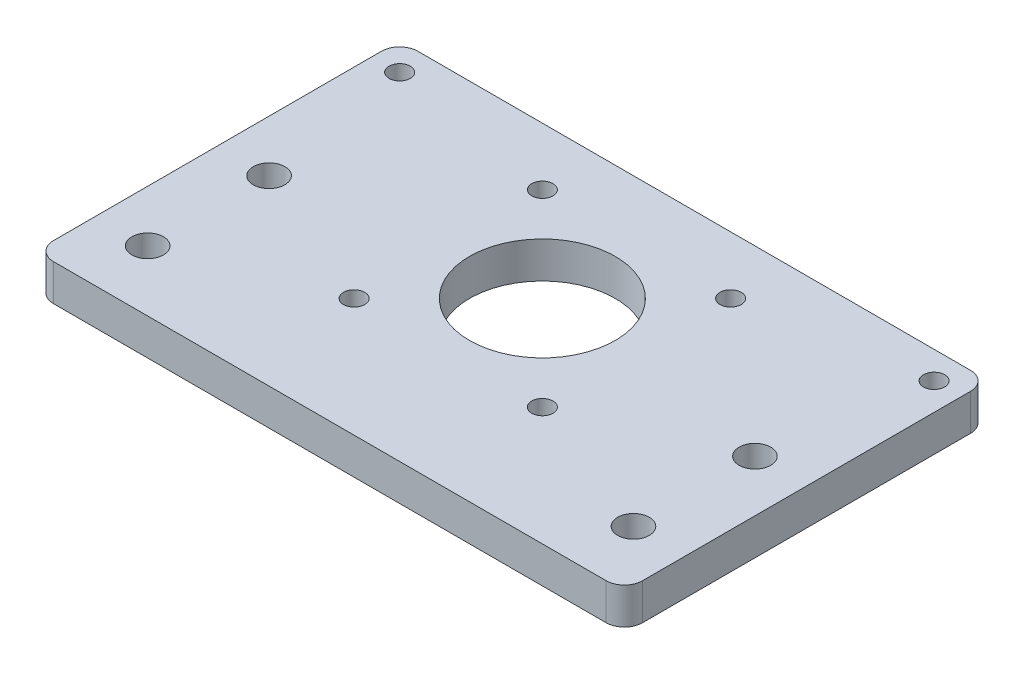
ISO-10303-21;
HEADER;
FILE_DESCRIPTION(('STEP AP214'),'2;1');
FILE_NAME('part.step','',(''),(''),'','','');
FILE_SCHEMA(('AUTOMOTIVE_DESIGN { 1 0 10303 214 1 1 1 1 }'));
ENDSEC;
DATA;
#1=APPLICATION_CONTEXT('core data for automotive mechanical design processes');
#2=APPLICATION_PROTOCOL_DEFINITION('international standard','automotive_design',2000,#1);
#3=PRODUCT_CONTEXT('',#1,'mechanical');
#4=PRODUCT('Part','Part','',(#3));
#5=PRODUCT_RELATED_PRODUCT_CATEGORY('part','',(#4));
#6=PRODUCT_DEFINITION_FORMATION('','',#4);
#7=PRODUCT_DEFINITION_CONTEXT('part definition',#1,'design');
#8=PRODUCT_DEFINITION('design','',#6,#7);
#9=PRODUCT_DEFINITION_SHAPE('','',#8);
#10=(LENGTH_UNIT() NAMED_UNIT(*) SI_UNIT(.MILLI.,.METRE.));
#11=(NAMED_UNIT(*) PLANE_ANGLE_UNIT() SI_UNIT($,.RADIAN.));
#12=(NAMED_UNIT(*) SI_UNIT($,.STERADIAN.) SOLID_ANGLE_UNIT());
#13=UNCERTAINTY_MEASURE_WITH_UNIT(LENGTH_MEASURE(1.E-05),#10,'distance_accuracy_value','');
#14=(GEOMETRIC_REPRESENTATION_CONTEXT(3) GLOBAL_UNCERTAINTY_ASSIGNED_CONTEXT((#13)) GLOBAL_UNIT_ASSIGNED_CONTEXT((#10,
#11,#12)) REPRESENTATION_CONTEXT('',''));
#15=CARTESIAN_POINT('',(0.,0.,0.));
#16=DIRECTION('',(0.,0.,1.));
#17=DIRECTION('',(1.,0.,0.));
#18=AXIS2_PLACEMENT_3D('',#15,#16,#17);
#19=CARTESIAN_POINT('',(-48.5,6.00000000000001,30.));
#20=DIRECTION('',(1.,0.,0.));
#21=DIRECTION('',(0.,0.,-1.));
#22=AXIS2_PLACEMENT_3D('',#19,#20,#21);
#23=PLANE('',#22);
#24=DIRECTION('',(0.,0.,1.));
#25=VECTOR('',#24,1.);
#26=CARTESIAN_POINT('',(-48.5,6.00000000000001,30.));
#27=LINE('',#26,#25);
#28=CARTESIAN_POINT('',(-48.5,6.00000000000001,-27.));
#29=VERTEX_POINT('',#28);
#30=CARTESIAN_POINT('',(-48.5,6.00000000000001,27.));
#31=VERTEX_POINT('',#30);
#32=EDGE_CURVE('E142',#29,#31,#27,.T.);
#33=ORIENTED_EDGE('',*,*,#32,.F.);
#34=DIRECTION('',(0.,-1.,0.));
#35=VECTOR('',#34,1.);
#36=CARTESIAN_POINT('',(-48.5,6.00000000000001,-27.));
#37=LINE('',#36,#35);
#38=CARTESIAN_POINT('',(-48.5,0.,-27.));
#39=VERTEX_POINT('',#38);
#40=EDGE_CURVE('E13',#29,#39,#37,.T.);
#41=ORIENTED_EDGE('',*,*,#40,.T.);
#42=DIRECTION('',(0.,0.,1.));
#43=VECTOR('',#42,1.);
#44=CARTESIAN_POINT('',(-48.5,0.,30.));
#45=LINE('',#44,#43);
#46=CARTESIAN_POINT('',(-48.5,0.,27.));
#47=VERTEX_POINT('',#46);
#48=EDGE_CURVE('E144',#39,#47,#45,.T.);
#49=ORIENTED_EDGE('',*,*,#48,.T.);
#50=DIRECTION('',(0.,-1.,0.));
#51=VECTOR('',#50,1.);
#52=CARTESIAN_POINT('',(-48.5,6.00000000000001,27.));
#53=LINE('',#52,#51);
#54=EDGE_CURVE('E55',#47,#31,#53,.F.);
#55=ORIENTED_EDGE('',*,*,#54,.T.);
#56=EDGE_LOOP('',(#33,#41,#49,#55));
#57=FACE_BOUND('',#56,.T.);
#58=ADVANCED_FACE('F47',(#57),#23,.F.);
#59=CARTESIAN_POINT('',(48.5,6.00000000000001,30.));
#60=DIRECTION('',(0.,0.,-1.));
#61=DIRECTION('',(-1.,0.,0.));
#62=AXIS2_PLACEMENT_3D('',#59,#60,#61);
#63=PLANE('',#62);
#64=DIRECTION('',(1.,0.,0.));
#65=VECTOR('',#64,1.);
#66=CARTESIAN_POINT('',(48.5,0.,30.));
#67=LINE('',#66,#65);
#68=CARTESIAN_POINT('',(-45.5,0.,30.));
#69=VERTEX_POINT('',#68);
#70=CARTESIAN_POINT('',(45.5,0.,30.));
#71=VERTEX_POINT('',#70);
#72=EDGE_CURVE('E140',#69,#71,#67,.T.);
#73=ORIENTED_EDGE('',*,*,#72,.T.);
#74=DIRECTION('',(0.,-1.,0.));
#75=VECTOR('',#74,1.);
#76=CARTESIAN_POINT('',(45.5,6.00000000000001,30.));
#77=LINE('',#76,#75);
#78=CARTESIAN_POINT('',(45.5,6.00000000000001,30.));
#79=VERTEX_POINT('',#78);
#80=EDGE_CURVE('E119',#71,#79,#77,.F.);
#81=ORIENTED_EDGE('',*,*,#80,.T.);
#82=DIRECTION('',(1.,0.,0.));
#83=VECTOR('',#82,1.);
#84=CARTESIAN_POINT('',(48.5,6.00000000000001,30.));
#85=LINE('',#84,#83);
#86=CARTESIAN_POINT('',(-45.5,6.00000000000001,30.));
#87=VERTEX_POINT('',#86);
#88=EDGE_CURVE('E180',#87,#79,#85,.T.);
#89=ORIENTED_EDGE('',*,*,#88,.F.);
#90=DIRECTION('',(0.,-1.,0.));
#91=VECTOR('',#90,1.);
#92=CARTESIAN_POINT('',(-45.5,6.00000000000001,30.));
#93=LINE('',#92,#91);
#94=EDGE_CURVE('E124',#87,#69,#93,.T.);
#95=ORIENTED_EDGE('',*,*,#94,.T.);
#96=EDGE_LOOP('',(#73,#81,#89,#95));
#97=FACE_BOUND('',#96,.T.);
#98=ADVANCED_FACE('F184',(#97),#63,.F.);
#99=CARTESIAN_POINT('',(48.5,6.00000000000001,30.));
#100=DIRECTION('',(-1.,0.,0.));
#101=DIRECTION('',(0.,0.,1.));
#102=AXIS2_PLACEMENT_3D('',#99,#100,#101);
#103=PLANE('',#102);
#104=DIRECTION('',(0.,0.,-1.));
#105=VECTOR('',#104,1.);
#106=CARTESIAN_POINT('',(48.5,6.00000000000001,30.));
#107=LINE('',#106,#105);
#108=CARTESIAN_POINT('',(48.5,6.00000000000001,27.));
#109=VERTEX_POINT('',#108);
#110=CARTESIAN_POINT('',(48.5,6.00000000000001,-27.));
#111=VERTEX_POINT('',#110);
#112=EDGE_CURVE('E133',#109,#111,#107,.T.);
#113=ORIENTED_EDGE('',*,*,#112,.F.);
#114=DIRECTION('',(0.,-1.,0.));
#115=VECTOR('',#114,1.);
#116=CARTESIAN_POINT('',(48.5,6.00000000000001,27.));
#117=LINE('',#116,#115);
#118=CARTESIAN_POINT('',(48.5,0.,27.));
#119=VERTEX_POINT('',#118);
#120=EDGE_CURVE('E118',#109,#119,#117,.T.);
#121=ORIENTED_EDGE('',*,*,#120,.T.);
#122=DIRECTION('',(0.,0.,-1.));
#123=VECTOR('',#122,1.);
#124=CARTESIAN_POINT('',(48.5,0.,30.));
#125=LINE('',#124,#123);
#126=CARTESIAN_POINT('',(48.5,0.,-27.));
#127=VERTEX_POINT('',#126);
#128=EDGE_CURVE('E131',#119,#127,#125,.T.);
#129=ORIENTED_EDGE('',*,*,#128,.T.);
#130=DIRECTION('',(0.,-1.,0.));
#131=VECTOR('',#130,1.);
#132=CARTESIAN_POINT('',(48.5,6.00000000000001,-27.));
#133=LINE('',#132,#131);
#134=EDGE_CURVE('E135',#127,#111,#133,.F.);
#135=ORIENTED_EDGE('',*,*,#134,.T.);
#136=EDGE_LOOP('',(#113,#121,#129,#135));
#137=FACE_BOUND('',#136,.T.);
#138=ADVANCED_FACE('F130',(#137),#103,.F.);
#139=CARTESIAN_POINT('',(48.5,6.00000000000001,-30.));
#140=DIRECTION('',(0.,0.,1.));
#141=DIRECTION('',(1.,0.,0.));
#142=AXIS2_PLACEMENT_3D('',#139,#140,#141);
#143=PLANE('',#142);
#144=DIRECTION('',(-1.,0.,0.));
#145=VECTOR('',#144,1.);
#146=CARTESIAN_POINT('',(48.5,6.00000000000001,-30.));
#147=LINE('',#146,#145);
#148=CARTESIAN_POINT('',(45.5,6.00000000000001,-30.));
#149=VERTEX_POINT('',#148);
#150=CARTESIAN_POINT('',(-45.5,6.00000000000001,-30.));
#151=VERTEX_POINT('',#150);
#152=EDGE_CURVE('E148',#149,#151,#147,.T.);
#153=ORIENTED_EDGE('',*,*,#152,.F.);
#154=DIRECTION('',(0.,-1.,0.));
#155=VECTOR('',#154,1.);
#156=CARTESIAN_POINT('',(45.5,6.00000000000001,-30.));
#157=LINE('',#156,#155);
#158=CARTESIAN_POINT('',(45.5,0.,-30.));
#159=VERTEX_POINT('',#158);
#160=EDGE_CURVE('E165',#149,#159,#157,.T.);
#161=ORIENTED_EDGE('',*,*,#160,.T.);
#162=DIRECTION('',(-1.,0.,0.));
#163=VECTOR('',#162,1.);
#164=CARTESIAN_POINT('',(48.5,0.,-30.));
#165=LINE('',#164,#163);
#166=CARTESIAN_POINT('',(-45.5,0.,-30.));
#167=VERTEX_POINT('',#166);
#168=EDGE_CURVE('E139',#159,#167,#165,.T.);
#169=ORIENTED_EDGE('',*,*,#168,.T.);
#170=DIRECTION('',(0.,-1.,0.));
#171=VECTOR('',#170,1.);
#172=CARTESIAN_POINT('',(-45.5,6.00000000000001,-30.));
#173=LINE('',#172,#171);
#174=EDGE_CURVE('E62',#167,#151,#173,.F.);
#175=ORIENTED_EDGE('',*,*,#174,.T.);
#176=EDGE_LOOP('',(#153,#161,#169,#175));
#177=FACE_BOUND('',#176,.T.);
#178=ADVANCED_FACE('F260',(#177),#143,.F.);
#179=CARTESIAN_POINT('',(0.,6.00000000000001,0.));
#180=DIRECTION('',(0.,1.,0.));
#181=DIRECTION('',(0.,0.,1.));
#182=AXIS2_PLACEMENT_3D('',#179,#180,#181);
#183=PLANE('',#182);
#184=CARTESIAN_POINT('',(-15.5,6.00000000000001,-20.5));
#185=DIRECTION('',(0.,1.,0.));
#186=DIRECTION('',(0.,0.,1.));
#187=AXIS2_PLACEMENT_3D('',#184,#185,#186);
#188=CIRCLE('',#187,1.75);
#189=CARTESIAN_POINT('',(-15.5,6.00000000000001,-18.75));
#190=VERTEX_POINT('',#189);
#191=EDGE_CURVE('E252',#190,#190,#188,.T.);
#192=ORIENTED_EDGE('',*,*,#191,.F.);
#193=EDGE_LOOP('',(#192));
#194=FACE_BOUND('',#193,.T.);
#195=CARTESIAN_POINT('',(-15.5,6.00000000000001,10.5));
#196=DIRECTION('',(0.,1.,0.));
#197=DIRECTION('',(0.,0.,1.));
#198=AXIS2_PLACEMENT_3D('',#195,#196,#197);
#199=CIRCLE('',#198,1.75);
#200=CARTESIAN_POINT('',(-15.5,6.00000000000001,12.25));
#201=VERTEX_POINT('',#200);
#202=EDGE_CURVE('E246',#201,#201,#199,.T.);
#203=ORIENTED_EDGE('',*,*,#202,.F.);
#204=EDGE_LOOP('',(#203));
#205=FACE_BOUND('',#204,.T.);
#206=CARTESIAN_POINT('',(15.5,6.00000000000001,10.5));
#207=DIRECTION('',(0.,1.,0.));
#208=DIRECTION('',(0.,0.,1.));
#209=AXIS2_PLACEMENT_3D('',#206,#207,#208);
#210=CIRCLE('',#209,1.75);
#211=CARTESIAN_POINT('',(15.5,6.00000000000001,12.25));
#212=VERTEX_POINT('',#211);
#213=EDGE_CURVE('E240',#212,#212,#210,.T.);
#214=ORIENTED_EDGE('',*,*,#213,.F.);
#215=EDGE_LOOP('',(#214));
#216=FACE_BOUND('',#215,.T.);
#217=CARTESIAN_POINT('',(15.5,6.00000000000001,-20.5));
#218=DIRECTION('',(0.,1.,0.));
#219=DIRECTION('',(0.,0.,1.));
#220=AXIS2_PLACEMENT_3D('',#217,#218,#219);
#221=CIRCLE('',#220,1.75);
#222=CARTESIAN_POINT('',(15.5,6.00000000000001,-18.75));
#223=VERTEX_POINT('',#222);
#224=EDGE_CURVE('E234',#223,#223,#221,.T.);
#225=ORIENTED_EDGE('',*,*,#224,.F.);
#226=EDGE_LOOP('',(#225));
#227=FACE_BOUND('',#226,.T.);
#228=CARTESIAN_POINT('',(-40.,6.00000000000001,0.));
#229=DIRECTION('',(0.,1.,0.));
#230=DIRECTION('',(0.,0.,1.));
#231=AXIS2_PLACEMENT_3D('',#228,#229,#230);
#232=CIRCLE('',#231,2.6);
#233=CARTESIAN_POINT('',(-40.,6.00000000000001,2.6));
#234=VERTEX_POINT('',#233);
#235=EDGE_CURVE('E228',#234,#234,#232,.T.);
#236=ORIENTED_EDGE('',*,*,#235,.F.);
#237=EDGE_LOOP('',(#236));
#238=FACE_BOUND('',#237,.T.);
#239=CARTESIAN_POINT('',(-40.,6.00000000000001,20.));
#240=DIRECTION('',(0.,1.,0.));
#241=DIRECTION('',(0.,0.,1.));
#242=AXIS2_PLACEMENT_3D('',#239,#240,#241);
#243=CIRCLE('',#242,2.6);
#244=CARTESIAN_POINT('',(-40.,6.00000000000001,22.6));
#245=VERTEX_POINT('',#244);
#246=EDGE_CURVE('E222',#245,#245,#243,.T.);
#247=ORIENTED_EDGE('',*,*,#246,.F.);
#248=EDGE_LOOP('',(#247));
#249=FACE_BOUND('',#248,.T.);
#250=CARTESIAN_POINT('',(40.,6.00000000000001,0.));
#251=DIRECTION('',(0.,1.,0.));
#252=DIRECTION('',(0.,0.,1.));
#253=AXIS2_PLACEMENT_3D('',#250,#251,#252);
#254=CIRCLE('',#253,2.6);
#255=CARTESIAN_POINT('',(40.,6.00000000000001,2.6));
#256=VERTEX_POINT('',#255);
#257=EDGE_CURVE('E216',#256,#256,#254,.T.);
#258=ORIENTED_EDGE('',*,*,#257,.F.);
#259=EDGE_LOOP('',(#258));
#260=FACE_BOUND('',#259,.T.);
#261=CARTESIAN_POINT('',(40.,6.00000000000001,20.));
#262=DIRECTION('',(0.,1.,0.));
#263=DIRECTION('',(0.,0.,1.));
#264=AXIS2_PLACEMENT_3D('',#261,#262,#263);
#265=CIRCLE('',#264,2.6);
#266=CARTESIAN_POINT('',(40.,6.00000000000001,22.6));
#267=VERTEX_POINT('',#266);
#268=EDGE_CURVE('E210',#267,#267,#265,.T.);
#269=ORIENTED_EDGE('',*,*,#268,.F.);
#270=EDGE_LOOP('',(#269));
#271=FACE_BOUND('',#270,.T.);
#272=CARTESIAN_POINT('',(44.,6.00000000000001,-25.5));
#273=DIRECTION('',(0.,-1.,0.));
#274=DIRECTION('',(0.,0.,-1.));
#275=AXIS2_PLACEMENT_3D('',#272,#273,#274);
#276=CIRCLE('',#275,1.75);
#277=CARTESIAN_POINT('',(44.,6.00000000000001,-27.25));
#278=VERTEX_POINT('',#277);
#279=EDGE_CURVE('E201',#278,#278,#276,.T.);
#280=ORIENTED_EDGE('',*,*,#279,.T.);
#281=EDGE_LOOP('',(#280));
#282=FACE_BOUND('',#281,.T.);
#283=CARTESIAN_POINT('',(-44.,6.00000000000001,-25.5));
#284=DIRECTION('',(0.,-1.,0.));
#285=DIRECTION('',(0.,0.,-1.));
#286=AXIS2_PLACEMENT_3D('',#283,#284,#285);
#287=CIRCLE('',#286,1.75);
#288=CARTESIAN_POINT('',(-44.,6.00000000000001,-27.25));
#289=VERTEX_POINT('',#288);
#290=EDGE_CURVE('E194',#289,#289,#287,.T.);
#291=ORIENTED_EDGE('',*,*,#290,.T.);
#292=EDGE_LOOP('',(#291));
#293=FACE_BOUND('',#292,.T.);
#294=CARTESIAN_POINT('',(0.,6.00000000000001,-5.));
#295=DIRECTION('',(0.,1.,0.));
#296=DIRECTION('',(0.,0.,1.));
#297=AXIS2_PLACEMENT_3D('',#294,#295,#296);
#298=CIRCLE('',#297,12.);
#299=CARTESIAN_POINT('',(0.,6.00000000000001,7.));
#300=VERTEX_POINT('',#299);
#301=EDGE_CURVE('E187',#300,#300,#298,.T.);
#302=ORIENTED_EDGE('',*,*,#301,.F.);
#303=EDGE_LOOP('',(#302));
#304=FACE_BOUND('',#303,.T.);
#305=ORIENTED_EDGE('',*,*,#88,.T.);
#306=CARTESIAN_POINT('',(45.5,6.00000000000001,27.));
#307=DIRECTION('',(0.,1.,0.));
#308=DIRECTION('',(0.,0.,1.));
#309=AXIS2_PLACEMENT_3D('',#306,#307,#308);
#310=CIRCLE('',#309,3.);
#311=EDGE_CURVE('E162',#79,#109,#310,.T.);
#312=ORIENTED_EDGE('',*,*,#311,.T.);
#313=ORIENTED_EDGE('',*,*,#112,.T.);
#314=CARTESIAN_POINT('',(45.5,6.00000000000001,-27.));
#315=DIRECTION('',(0.,1.,0.));
#316=DIRECTION('',(0.,0.,1.));
#317=AXIS2_PLACEMENT_3D('',#314,#315,#316);
#318=CIRCLE('',#317,3.);
#319=EDGE_CURVE('E69',#111,#149,#318,.T.);
#320=ORIENTED_EDGE('',*,*,#319,.T.);
#321=ORIENTED_EDGE('',*,*,#152,.T.);
#322=CARTESIAN_POINT('',(-45.5,6.00000000000001,-27.));
#323=DIRECTION('',(0.,1.,0.));
#324=DIRECTION('',(0.,0.,1.));
#325=AXIS2_PLACEMENT_3D('',#322,#323,#324);
#326=CIRCLE('',#325,3.);
#327=EDGE_CURVE('E159',#151,#29,#326,.T.);
#328=ORIENTED_EDGE('',*,*,#327,.T.);
#329=ORIENTED_EDGE('',*,*,#32,.T.);
#330=CARTESIAN_POINT('',(-45.5,6.00000000000001,27.));
#331=DIRECTION('',(0.,1.,0.));
#332=DIRECTION('',(0.,0.,1.));
#333=AXIS2_PLACEMENT_3D('',#330,#331,#332);
#334=CIRCLE('',#333,3.);
#335=EDGE_CURVE('E157',#31,#87,#334,.T.);
#336=ORIENTED_EDGE('',*,*,#335,.T.);
#337=EDGE_LOOP('',(#305,#312,#313,#320,#321,#328,#329,#336));
#338=FACE_BOUND('',#337,.T.);
#339=ADVANCED_FACE('F177',(#194,#205,#216,#227,#238,#249,#260,#271,#282,#293,#304,#338),#183,.T.);
#340=CARTESIAN_POINT('',(0.,0.,0.));
#341=DIRECTION('',(0.,1.,0.));
#342=DIRECTION('',(0.,0.,1.));
#343=AXIS2_PLACEMENT_3D('',#340,#341,#342);
#344=PLANE('',#343);
#345=CARTESIAN_POINT('',(-15.5,0.,-20.5));
#346=DIRECTION('',(0.,1.,0.));
#347=DIRECTION('',(0.,0.,1.));
#348=AXIS2_PLACEMENT_3D('',#345,#346,#347);
#349=CIRCLE('',#348,1.75);
#350=CARTESIAN_POINT('',(-15.5,0.,-18.75));
#351=VERTEX_POINT('',#350);
#352=EDGE_CURVE('E249',#351,#351,#349,.T.);
#353=ORIENTED_EDGE('',*,*,#352,.T.);
#354=EDGE_LOOP('',(#353));
#355=FACE_BOUND('',#354,.T.);
#356=CARTESIAN_POINT('',(-15.5,0.,10.5));
#357=DIRECTION('',(0.,1.,0.));
#358=DIRECTION('',(0.,0.,1.));
#359=AXIS2_PLACEMENT_3D('',#356,#357,#358);
#360=CIRCLE('',#359,1.75);
#361=CARTESIAN_POINT('',(-15.5,0.,12.25));
#362=VERTEX_POINT('',#361);
#363=EDGE_CURVE('E243',#362,#362,#360,.T.);
#364=ORIENTED_EDGE('',*,*,#363,.T.);
#365=EDGE_LOOP('',(#364));
#366=FACE_BOUND('',#365,.T.);
#367=CARTESIAN_POINT('',(15.5,0.,10.5));
#368=DIRECTION('',(0.,1.,0.));
#369=DIRECTION('',(0.,0.,1.));
#370=AXIS2_PLACEMENT_3D('',#367,#368,#369);
#371=CIRCLE('',#370,1.75);
#372=CARTESIAN_POINT('',(15.5,0.,12.25));
#373=VERTEX_POINT('',#372);
#374=EDGE_CURVE('E237',#373,#373,#371,.T.);
#375=ORIENTED_EDGE('',*,*,#374,.T.);
#376=EDGE_LOOP('',(#375));
#377=FACE_BOUND('',#376,.T.);
#378=CARTESIAN_POINT('',(15.5,0.,-20.5));
#379=DIRECTION('',(0.,1.,0.));
#380=DIRECTION('',(0.,0.,1.));
#381=AXIS2_PLACEMENT_3D('',#378,#379,#380);
#382=CIRCLE('',#381,1.75);
#383=CARTESIAN_POINT('',(15.5,0.,-18.75));
#384=VERTEX_POINT('',#383);
#385=EDGE_CURVE('E231',#384,#384,#382,.T.);
#386=ORIENTED_EDGE('',*,*,#385,.T.);
#387=EDGE_LOOP('',(#386));
#388=FACE_BOUND('',#387,.T.);
#389=CARTESIAN_POINT('',(-40.,0.,0.));
#390=DIRECTION('',(0.,1.,0.));
#391=DIRECTION('',(0.,0.,1.));
#392=AXIS2_PLACEMENT_3D('',#389,#390,#391);
#393=CIRCLE('',#392,2.6);
#394=CARTESIAN_POINT('',(-40.,0.,2.6));
#395=VERTEX_POINT('',#394);
#396=EDGE_CURVE('E225',#395,#395,#393,.T.);
#397=ORIENTED_EDGE('',*,*,#396,.T.);
#398=EDGE_LOOP('',(#397));
#399=FACE_BOUND('',#398,.T.);
#400=CARTESIAN_POINT('',(-40.,0.,20.));
#401=DIRECTION('',(0.,1.,0.));
#402=DIRECTION('',(0.,0.,1.));
#403=AXIS2_PLACEMENT_3D('',#400,#401,#402);
#404=CIRCLE('',#403,2.6);
#405=CARTESIAN_POINT('',(-40.,0.,22.6));
#406=VERTEX_POINT('',#405);
#407=EDGE_CURVE('E219',#406,#406,#404,.T.);
#408=ORIENTED_EDGE('',*,*,#407,.T.);
#409=EDGE_LOOP('',(#408));
#410=FACE_BOUND('',#409,.T.);
#411=CARTESIAN_POINT('',(40.,0.,0.));
#412=DIRECTION('',(0.,1.,0.));
#413=DIRECTION('',(0.,0.,1.));
#414=AXIS2_PLACEMENT_3D('',#411,#412,#413);
#415=CIRCLE('',#414,2.6);
#416=CARTESIAN_POINT('',(40.,0.,2.6));
#417=VERTEX_POINT('',#416);
#418=EDGE_CURVE('E213',#417,#417,#415,.T.);
#419=ORIENTED_EDGE('',*,*,#418,.T.);
#420=EDGE_LOOP('',(#419));
#421=FACE_BOUND('',#420,.T.);
#422=CARTESIAN_POINT('',(40.,0.,20.));
#423=DIRECTION('',(0.,1.,0.));
#424=DIRECTION('',(0.,0.,1.));
#425=AXIS2_PLACEMENT_3D('',#422,#423,#424);
#426=CIRCLE('',#425,2.6);
#427=CARTESIAN_POINT('',(40.,0.,22.6));
#428=VERTEX_POINT('',#427);
#429=EDGE_CURVE('E207',#428,#428,#426,.T.);
#430=ORIENTED_EDGE('',*,*,#429,.T.);
#431=EDGE_LOOP('',(#430));
#432=FACE_BOUND('',#431,.T.);
#433=CARTESIAN_POINT('',(44.,0.,-25.5));
#434=DIRECTION('',(0.,-1.,0.));
#435=DIRECTION('',(0.,0.,-1.));
#436=AXIS2_PLACEMENT_3D('',#433,#434,#435);
#437=CIRCLE('',#436,1.75);
#438=CARTESIAN_POINT('',(44.,0.,-27.25));
#439=VERTEX_POINT('',#438);
#440=EDGE_CURVE('E204',#439,#439,#437,.T.);
#441=ORIENTED_EDGE('',*,*,#440,.F.);
#442=EDGE_LOOP('',(#441));
#443=FACE_BOUND('',#442,.T.);
#444=CARTESIAN_POINT('',(-44.,0.,-25.5));
#445=DIRECTION('',(0.,-1.,0.));
#446=DIRECTION('',(0.,0.,-1.));
#447=AXIS2_PLACEMENT_3D('',#444,#445,#446);
#448=CIRCLE('',#447,1.75);
#449=CARTESIAN_POINT('',(-44.,0.,-27.25));
#450=VERTEX_POINT('',#449);
#451=EDGE_CURVE('E198',#450,#450,#448,.T.);
#452=ORIENTED_EDGE('',*,*,#451,.F.);
#453=EDGE_LOOP('',(#452));
#454=FACE_BOUND('',#453,.T.);
#455=CARTESIAN_POINT('',(0.,0.,-5.));
#456=DIRECTION('',(0.,1.,0.));
#457=DIRECTION('',(0.,0.,1.));
#458=AXIS2_PLACEMENT_3D('',#455,#456,#457);
#459=CIRCLE('',#458,12.);
#460=CARTESIAN_POINT('',(0.,0.,7.));
#461=VERTEX_POINT('',#460);
#462=EDGE_CURVE('E185',#461,#461,#459,.T.);
#463=ORIENTED_EDGE('',*,*,#462,.T.);
#464=EDGE_LOOP('',(#463));
#465=FACE_BOUND('',#464,.T.);
#466=ORIENTED_EDGE('',*,*,#128,.F.);
#467=CARTESIAN_POINT('',(45.5,0.,27.));
#468=DIRECTION('',(0.,1.,0.));
#469=DIRECTION('',(0.,0.,1.));
#470=AXIS2_PLACEMENT_3D('',#467,#468,#469);
#471=CIRCLE('',#470,3.);
#472=EDGE_CURVE('E114',#119,#71,#471,.F.);
#473=ORIENTED_EDGE('',*,*,#472,.T.);
#474=ORIENTED_EDGE('',*,*,#72,.F.);
#475=CARTESIAN_POINT('',(-45.5,0.,27.));
#476=DIRECTION('',(0.,1.,0.));
#477=DIRECTION('',(0.,0.,1.));
#478=AXIS2_PLACEMENT_3D('',#475,#476,#477);
#479=CIRCLE('',#478,3.);
#480=EDGE_CURVE('E134',#69,#47,#479,.F.);
#481=ORIENTED_EDGE('',*,*,#480,.T.);
#482=ORIENTED_EDGE('',*,*,#48,.F.);
#483=CARTESIAN_POINT('',(-45.5,0.,-27.));
#484=DIRECTION('',(0.,1.,0.));
#485=DIRECTION('',(0.,0.,1.));
#486=AXIS2_PLACEMENT_3D('',#483,#484,#485);
#487=CIRCLE('',#486,3.);
#488=EDGE_CURVE('E151',#39,#167,#487,.F.);
#489=ORIENTED_EDGE('',*,*,#488,.T.);
#490=ORIENTED_EDGE('',*,*,#168,.F.);
#491=CARTESIAN_POINT('',(45.5,0.,-27.));
#492=DIRECTION('',(0.,1.,0.));
#493=DIRECTION('',(0.,0.,1.));
#494=AXIS2_PLACEMENT_3D('',#491,#492,#493);
#495=CIRCLE('',#494,3.);
#496=EDGE_CURVE('E125',#159,#127,#495,.F.);
#497=ORIENTED_EDGE('',*,*,#496,.T.);
#498=EDGE_LOOP('',(#466,#473,#474,#481,#482,#489,#490,#497));
#499=FACE_BOUND('',#498,.T.);
#500=ADVANCED_FACE('F137',(#355,#366,#377,#388,#399,#410,#421,#432,#443,#454,#465,#499),#344,.F.);
#501=CARTESIAN_POINT('',(0.,0.,-5.));
#502=DIRECTION('',(0.,1.,0.));
#503=DIRECTION('',(0.,0.,1.));
#504=AXIS2_PLACEMENT_3D('',#501,#502,#503);
#505=CYLINDRICAL_SURFACE('',#504,12.);
#506=ORIENTED_EDGE('',*,*,#462,.F.);
#507=EDGE_LOOP('',(#506));
#508=FACE_BOUND('',#507,.T.);
#509=ORIENTED_EDGE('',*,*,#301,.T.);
#510=EDGE_LOOP('',(#509));
#511=FACE_BOUND('',#510,.T.);
#512=ADVANCED_FACE('F282',(#508,#511),#505,.F.);
#513=CARTESIAN_POINT('',(45.5,6.00000000000001,27.));
#514=DIRECTION('',(0.,-1.,0.));
#515=DIRECTION('',(0.,0.,-1.));
#516=AXIS2_PLACEMENT_3D('',#513,#514,#515);
#517=CYLINDRICAL_SURFACE('',#516,3.);
#518=ORIENTED_EDGE('',*,*,#311,.F.);
#519=ORIENTED_EDGE('',*,*,#80,.F.);
#520=ORIENTED_EDGE('',*,*,#472,.F.);
#521=ORIENTED_EDGE('',*,*,#120,.F.);
#522=EDGE_LOOP('',(#518,#519,#520,#521));
#523=FACE_BOUND('',#522,.T.);
#524=ADVANCED_FACE('F117',(#523),#517,.T.);
#525=CARTESIAN_POINT('',(45.5,6.00000000000001,-27.));
#526=DIRECTION('',(0.,-1.,0.));
#527=DIRECTION('',(0.,0.,-1.));
#528=AXIS2_PLACEMENT_3D('',#525,#526,#527);
#529=CYLINDRICAL_SURFACE('',#528,3.);
#530=ORIENTED_EDGE('',*,*,#319,.F.);
#531=ORIENTED_EDGE('',*,*,#134,.F.);
#532=ORIENTED_EDGE('',*,*,#496,.F.);
#533=ORIENTED_EDGE('',*,*,#160,.F.);
#534=EDGE_LOOP('',(#530,#531,#532,#533));
#535=FACE_BOUND('',#534,.T.);
#536=ADVANCED_FACE('F290',(#535),#529,.T.);
#537=CARTESIAN_POINT('',(-45.5,6.00000000000001,-27.));
#538=DIRECTION('',(0.,-1.,0.));
#539=DIRECTION('',(0.,0.,-1.));
#540=AXIS2_PLACEMENT_3D('',#537,#538,#539);
#541=CYLINDRICAL_SURFACE('',#540,3.);
#542=ORIENTED_EDGE('',*,*,#327,.F.);
#543=ORIENTED_EDGE('',*,*,#174,.F.);
#544=ORIENTED_EDGE('',*,*,#488,.F.);
#545=ORIENTED_EDGE('',*,*,#40,.F.);
#546=EDGE_LOOP('',(#542,#543,#544,#545));
#547=FACE_BOUND('',#546,.T.);
#548=ADVANCED_FACE('F305',(#547),#541,.T.);
#549=CARTESIAN_POINT('',(-45.5,6.00000000000001,27.));
#550=DIRECTION('',(0.,-1.,0.));
#551=DIRECTION('',(0.,0.,-1.));
#552=AXIS2_PLACEMENT_3D('',#549,#550,#551);
#553=CYLINDRICAL_SURFACE('',#552,3.);
#554=ORIENTED_EDGE('',*,*,#335,.F.);
#555=ORIENTED_EDGE('',*,*,#54,.F.);
#556=ORIENTED_EDGE('',*,*,#480,.F.);
#557=ORIENTED_EDGE('',*,*,#94,.F.);
#558=EDGE_LOOP('',(#554,#555,#556,#557));
#559=FACE_BOUND('',#558,.T.);
#560=ADVANCED_FACE('F49',(#559),#553,.T.);
#561=CARTESIAN_POINT('',(-44.,0.,-25.5));
#562=DIRECTION('',(0.,-1.,0.));
#563=DIRECTION('',(0.,0.,-1.));
#564=AXIS2_PLACEMENT_3D('',#561,#562,#563);
#565=CYLINDRICAL_SURFACE('',#564,1.75);
#566=ORIENTED_EDGE('',*,*,#290,.F.);
#567=EDGE_LOOP('',(#566));
#568=FACE_BOUND('',#567,.T.);
#569=ORIENTED_EDGE('',*,*,#451,.T.);
#570=EDGE_LOOP('',(#569));
#571=FACE_BOUND('',#570,.T.);
#572=ADVANCED_FACE('F312',(#568,#571),#565,.F.);
#573=CARTESIAN_POINT('',(44.,0.,-25.5));
#574=DIRECTION('',(0.,-1.,0.));
#575=DIRECTION('',(0.,0.,-1.));
#576=AXIS2_PLACEMENT_3D('',#573,#574,#575);
#577=CYLINDRICAL_SURFACE('',#576,1.75);
#578=ORIENTED_EDGE('',*,*,#279,.F.);
#579=EDGE_LOOP('',(#578));
#580=FACE_BOUND('',#579,.T.);
#581=ORIENTED_EDGE('',*,*,#440,.T.);
#582=EDGE_LOOP('',(#581));
#583=FACE_BOUND('',#582,.T.);
#584=ADVANCED_FACE('F316',(#580,#583),#577,.F.);
#585=CARTESIAN_POINT('',(40.,6.00000000000001,20.));
#586=DIRECTION('',(0.,1.,0.));
#587=DIRECTION('',(0.,0.,1.));
#588=AXIS2_PLACEMENT_3D('',#585,#586,#587);
#589=CYLINDRICAL_SURFACE('',#588,2.6);
#590=ORIENTED_EDGE('',*,*,#429,.F.);
#591=EDGE_LOOP('',(#590));
#592=FACE_BOUND('',#591,.T.);
#593=ORIENTED_EDGE('',*,*,#268,.T.);
#594=EDGE_LOOP('',(#593));
#595=FACE_BOUND('',#594,.T.);
#596=ADVANCED_FACE('F321',(#592,#595),#589,.F.);
#597=CARTESIAN_POINT('',(40.,6.00000000000001,0.));
#598=DIRECTION('',(0.,1.,0.));
#599=DIRECTION('',(0.,0.,1.));
#600=AXIS2_PLACEMENT_3D('',#597,#598,#599);
#601=CYLINDRICAL_SURFACE('',#600,2.6);
#602=ORIENTED_EDGE('',*,*,#418,.F.);
#603=EDGE_LOOP('',(#602));
#604=FACE_BOUND('',#603,.T.);
#605=ORIENTED_EDGE('',*,*,#257,.T.);
#606=EDGE_LOOP('',(#605));
#607=FACE_BOUND('',#606,.T.);
#608=ADVANCED_FACE('F328',(#604,#607),#601,.F.);
#609=CARTESIAN_POINT('',(-40.,6.00000000000001,20.));
#610=DIRECTION('',(0.,1.,0.));
#611=DIRECTION('',(0.,0.,1.));
#612=AXIS2_PLACEMENT_3D('',#609,#610,#611);
#613=CYLINDRICAL_SURFACE('',#612,2.6);
#614=ORIENTED_EDGE('',*,*,#407,.F.);
#615=EDGE_LOOP('',(#614));
#616=FACE_BOUND('',#615,.T.);
#617=ORIENTED_EDGE('',*,*,#246,.T.);
#618=EDGE_LOOP('',(#617));
#619=FACE_BOUND('',#618,.T.);
#620=ADVANCED_FACE('F332',(#616,#619),#613,.F.);
#621=CARTESIAN_POINT('',(-40.,6.00000000000001,0.));
#622=DIRECTION('',(0.,1.,0.));
#623=DIRECTION('',(0.,0.,1.));
#624=AXIS2_PLACEMENT_3D('',#621,#622,#623);
#625=CYLINDRICAL_SURFACE('',#624,2.6);
#626=ORIENTED_EDGE('',*,*,#396,.F.);
#627=EDGE_LOOP('',(#626));
#628=FACE_BOUND('',#627,.T.);
#629=ORIENTED_EDGE('',*,*,#235,.T.);
#630=EDGE_LOOP('',(#629));
#631=FACE_BOUND('',#630,.T.);
#632=ADVANCED_FACE('F336',(#628,#631),#625,.F.);
#633=CARTESIAN_POINT('',(15.5,6.00000000000001,-20.5));
#634=DIRECTION('',(0.,1.,0.));
#635=DIRECTION('',(0.,0.,1.));
#636=AXIS2_PLACEMENT_3D('',#633,#634,#635);
#637=CYLINDRICAL_SURFACE('',#636,1.75);
#638=ORIENTED_EDGE('',*,*,#385,.F.);
#639=EDGE_LOOP('',(#638));
#640=FACE_BOUND('',#639,.T.);
#641=ORIENTED_EDGE('',*,*,#224,.T.);
#642=EDGE_LOOP('',(#641));
#643=FACE_BOUND('',#642,.T.);
#644=ADVANCED_FACE('F340',(#640,#643),#637,.F.);
#645=CARTESIAN_POINT('',(15.5,6.00000000000001,10.5));
#646=DIRECTION('',(0.,1.,0.));
#647=DIRECTION('',(0.,0.,1.));
#648=AXIS2_PLACEMENT_3D('',#645,#646,#647);
#649=CYLINDRICAL_SURFACE('',#648,1.75);
#650=ORIENTED_EDGE('',*,*,#374,.F.);
#651=EDGE_LOOP('',(#650));
#652=FACE_BOUND('',#651,.T.);
#653=ORIENTED_EDGE('',*,*,#213,.T.);
#654=EDGE_LOOP('',(#653));
#655=FACE_BOUND('',#654,.T.);
#656=ADVANCED_FACE('F344',(#652,#655),#649,.F.);
#657=CARTESIAN_POINT('',(-15.5,6.00000000000001,10.5));
#658=DIRECTION('',(0.,1.,0.));
#659=DIRECTION('',(0.,0.,1.));
#660=AXIS2_PLACEMENT_3D('',#657,#658,#659);
#661=CYLINDRICAL_SURFACE('',#660,1.75);
#662=ORIENTED_EDGE('',*,*,#363,.F.);
#663=EDGE_LOOP('',(#662));
#664=FACE_BOUND('',#663,.T.);
#665=ORIENTED_EDGE('',*,*,#202,.T.);
#666=EDGE_LOOP('',(#665));
#667=FACE_BOUND('',#666,.T.);
#668=ADVANCED_FACE('F348',(#664,#667),#661,.F.);
#669=CARTESIAN_POINT('',(-15.5,6.00000000000001,-20.5));
#670=DIRECTION('',(0.,1.,0.));
#671=DIRECTION('',(0.,0.,1.));
#672=AXIS2_PLACEMENT_3D('',#669,#670,#671);
#673=CYLINDRICAL_SURFACE('',#672,1.75);
#674=ORIENTED_EDGE('',*,*,#352,.F.);
#675=EDGE_LOOP('',(#674));
#676=FACE_BOUND('',#675,.T.);
#677=ORIENTED_EDGE('',*,*,#191,.T.);
#678=EDGE_LOOP('',(#677));
#679=FACE_BOUND('',#678,.T.);
#680=ADVANCED_FACE('F256',(#676,#679),#673,.F.);
#681=CLOSED_SHELL('',(#58,#98,#138,#178,#339,#500,#512,#524,#536,#548,#560,#572,#584,#596,#608,
#620,#632,#644,#656,#668,#680));
#682=MANIFOLD_SOLID_BREP('B2',#681);
#683=ADVANCED_BREP_SHAPE_REPRESENTATION('',(#18,#682),#14);
#684=SHAPE_DEFINITION_REPRESENTATION(#9,#683);
ENDSEC;
END-ISO-10303-21;
